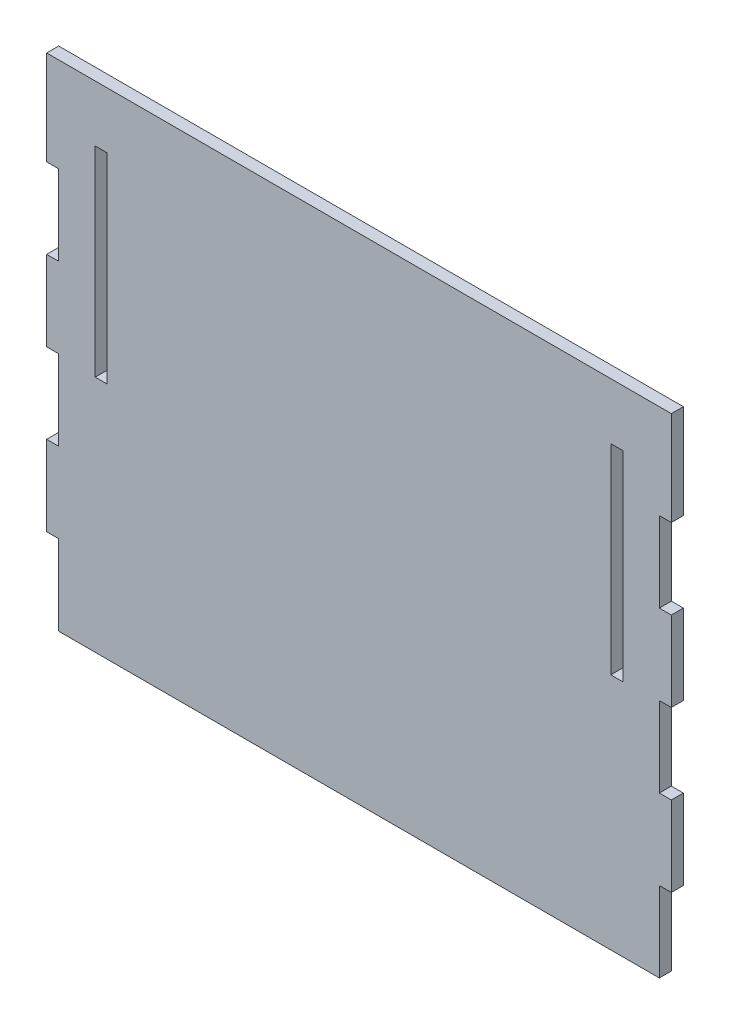
ISO-10303-21;
HEADER;
FILE_DESCRIPTION(('STEP AP214'),'2;1');
FILE_NAME('part.step','',(''),(''),'','','');
FILE_SCHEMA(('AUTOMOTIVE_DESIGN { 1 0 10303 214 1 1 1 1 }'));
ENDSEC;
DATA;
#1=APPLICATION_CONTEXT('core data for automotive mechanical design processes');
#2=APPLICATION_PROTOCOL_DEFINITION('international standard','automotive_design',2000,#1);
#3=PRODUCT_CONTEXT('',#1,'mechanical');
#4=PRODUCT('Part','Part','',(#3));
#5=PRODUCT_RELATED_PRODUCT_CATEGORY('part','',(#4));
#6=PRODUCT_DEFINITION_FORMATION('','',#4);
#7=PRODUCT_DEFINITION_CONTEXT('part definition',#1,'design');
#8=PRODUCT_DEFINITION('design','',#6,#7);
#9=PRODUCT_DEFINITION_SHAPE('','',#8);
#10=(LENGTH_UNIT() NAMED_UNIT(*) SI_UNIT(.MILLI.,.METRE.));
#11=(NAMED_UNIT(*) PLANE_ANGLE_UNIT() SI_UNIT($,.RADIAN.));
#12=(NAMED_UNIT(*) SI_UNIT($,.STERADIAN.) SOLID_ANGLE_UNIT());
#13=UNCERTAINTY_MEASURE_WITH_UNIT(LENGTH_MEASURE(1.E-05),#10,'distance_accuracy_value','');
#14=(GEOMETRIC_REPRESENTATION_CONTEXT(3) GLOBAL_UNCERTAINTY_ASSIGNED_CONTEXT((#13)) GLOBAL_UNIT_ASSIGNED_CONTEXT((#10,
#11,#12)) REPRESENTATION_CONTEXT('',''));
#15=CARTESIAN_POINT('',(0.,0.,0.));
#16=DIRECTION('',(0.,0.,1.));
#17=DIRECTION('',(1.,0.,0.));
#18=AXIS2_PLACEMENT_3D('',#15,#16,#17);
#19=CARTESIAN_POINT('',(0.,0.,0.));
#20=DIRECTION('',(0.,0.,1.));
#21=DIRECTION('',(1.,0.,0.));
#22=AXIS2_PLACEMENT_3D('',#19,#20,#21);
#23=PLANE('',#22);
#24=DIRECTION('',(1.,0.,0.));
#25=VECTOR('',#24,1.);
#26=CARTESIAN_POINT('',(-283.749999999988,53.3068090026658,0.));
#27=LINE('',#26,#25);
#28=CARTESIAN_POINT('',(-283.749999999988,53.3068090026658,0.));
#29=VERTEX_POINT('',#28);
#30=CARTESIAN_POINT('',(-277.749999999989,53.3068090026658,0.));
#31=VERTEX_POINT('',#30);
#32=EDGE_CURVE('E375',#29,#31,#27,.T.);
#33=ORIENTED_EDGE('',*,*,#32,.T.);
#34=DIRECTION('',(0.,1.,0.));
#35=VECTOR('',#34,1.);
#36=CARTESIAN_POINT('',(-277.749999999989,53.3068090026658,0.));
#37=LINE('',#36,#35);
#38=CARTESIAN_POINT('',(-277.749999999988,153.306809005423,0.));
#39=VERTEX_POINT('',#38);
#40=EDGE_CURVE('E378',#31,#39,#37,.T.);
#41=ORIENTED_EDGE('',*,*,#40,.T.);
#42=DIRECTION('',(-1.,0.,0.));
#43=VECTOR('',#42,1.);
#44=CARTESIAN_POINT('',(-277.749999999988,153.306809005423,0.));
#45=LINE('',#44,#43);
#46=CARTESIAN_POINT('',(-283.749999999988,153.306809005423,0.));
#47=VERTEX_POINT('',#46);
#48=EDGE_CURVE('E194',#39,#47,#45,.T.);
#49=ORIENTED_EDGE('',*,*,#48,.T.);
#50=DIRECTION('',(0.,-1.,0.));
#51=VECTOR('',#50,1.);
#52=CARTESIAN_POINT('',(-283.749999999988,153.306809005423,0.));
#53=LINE('',#52,#51);
#54=EDGE_CURVE('E191',#47,#29,#53,.T.);
#55=ORIENTED_EDGE('',*,*,#54,.T.);
#56=EDGE_LOOP('',(#33,#41,#49,#55));
#57=FACE_BOUND('',#56,.T.);
#58=DIRECTION('',(0.,-1.,0.));
#59=VECTOR('',#58,1.);
#60=CARTESIAN_POINT('',(-307.99999999955,181.409908729636,0.));
#61=LINE('',#60,#59);
#62=CARTESIAN_POINT('',(-307.99999999955,181.409908729636,0.));
#63=VERTEX_POINT('',#62);
#64=CARTESIAN_POINT('',(-307.99999999955,134.306808998087,0.));
#65=VERTEX_POINT('',#64);
#66=EDGE_CURVE('E203',#63,#65,#61,.T.);
#67=ORIENTED_EDGE('',*,*,#66,.F.);
#68=DIRECTION('',(-1.,-1.6765570413475E-11,0.));
#69=VECTOR('',#68,1.);
#70=CARTESIAN_POINT('',(-301.99999999955,181.409908729636,0.));
#71=LINE('',#70,#69);
#72=CARTESIAN_POINT('',(3.99999999999985,181.409908734666,0.));
#73=VERTEX_POINT('',#72);
#74=EDGE_CURVE('E294',#73,#63,#71,.T.);
#75=ORIENTED_EDGE('',*,*,#74,.F.);
#76=DIRECTION('',(0.,1.,0.));
#77=VECTOR('',#76,1.);
#78=CARTESIAN_POINT('',(3.9999999999999,134.306809003117,0.));
#79=LINE('',#78,#77);
#80=CARTESIAN_POINT('',(3.9999999999999,134.306809003117,0.));
#81=VERTEX_POINT('',#80);
#82=EDGE_CURVE('E290',#81,#73,#79,.T.);
#83=ORIENTED_EDGE('',*,*,#82,.F.);
#84=DIRECTION('',(1.,0.,0.));
#85=VECTOR('',#84,1.);
#86=CARTESIAN_POINT('',(-2.0000000000001,134.306809003117,0.));
#87=LINE('',#86,#85);
#88=CARTESIAN_POINT('',(-2.0000000000001,134.306809003117,0.));
#89=VERTEX_POINT('',#88);
#90=EDGE_CURVE('E286',#89,#81,#87,.T.);
#91=ORIENTED_EDGE('',*,*,#90,.F.);
#92=DIRECTION('',(0.,1.,0.));
#93=VECTOR('',#92,1.);
#94=CARTESIAN_POINT('',(-2.0000000000001,134.306809003117,0.));
#95=LINE('',#94,#93);
#96=CARTESIAN_POINT('',(-2.00000000000007,94.306809003117,0.));
#97=VERTEX_POINT('',#96);
#98=EDGE_CURVE('E282',#97,#89,#95,.T.);
#99=ORIENTED_EDGE('',*,*,#98,.F.);
#100=DIRECTION('',(-1.,0.,0.));
#101=VECTOR('',#100,1.);
#102=CARTESIAN_POINT('',(3.99999999999993,94.306809003117,0.));
#103=LINE('',#102,#101);
#104=CARTESIAN_POINT('',(3.99999999999993,94.306809003117,0.));
#105=VERTEX_POINT('',#104);
#106=EDGE_CURVE('E278',#105,#97,#103,.T.);
#107=ORIENTED_EDGE('',*,*,#106,.F.);
#108=DIRECTION('',(0.,1.,0.));
#109=VECTOR('',#108,1.);
#110=CARTESIAN_POINT('',(3.99999999999997,54.306809003117,0.));
#111=LINE('',#110,#109);
#112=CARTESIAN_POINT('',(3.99999999999997,54.306809003117,0.));
#113=VERTEX_POINT('',#112);
#114=EDGE_CURVE('E274',#113,#105,#111,.T.);
#115=ORIENTED_EDGE('',*,*,#114,.F.);
#116=DIRECTION('',(1.,0.,0.));
#117=VECTOR('',#116,1.);
#118=CARTESIAN_POINT('',(-2.00000000000003,54.306809003117,0.));
#119=LINE('',#118,#117);
#120=CARTESIAN_POINT('',(-2.00000000000003,54.306809003117,0.));
#121=VERTEX_POINT('',#120);
#122=EDGE_CURVE('E270',#121,#113,#119,.T.);
#123=ORIENTED_EDGE('',*,*,#122,.F.);
#124=DIRECTION('',(0.,1.,0.));
#125=VECTOR('',#124,1.);
#126=CARTESIAN_POINT('',(-2.00000000000003,54.306809003117,0.));
#127=LINE('',#126,#125);
#128=CARTESIAN_POINT('',(-1.99999999999999,14.3068090031171,0.));
#129=VERTEX_POINT('',#128);
#130=EDGE_CURVE('E266',#129,#121,#127,.T.);
#131=ORIENTED_EDGE('',*,*,#130,.F.);
#132=DIRECTION('',(-1.,0.,0.));
#133=VECTOR('',#132,1.);
#134=CARTESIAN_POINT('',(4.00000000000001,14.3068090031171,0.));
#135=LINE('',#134,#133);
#136=CARTESIAN_POINT('',(4.00000000000001,14.3068090031171,0.));
#137=VERTEX_POINT('',#136);
#138=EDGE_CURVE('E262',#137,#129,#135,.T.);
#139=ORIENTED_EDGE('',*,*,#138,.F.);
#140=DIRECTION('',(0.,1.,0.));
#141=VECTOR('',#140,1.);
#142=CARTESIAN_POINT('',(4.00000000000005,-25.6931909968829,0.));
#143=LINE('',#142,#141);
#144=CARTESIAN_POINT('',(4.00000000000005,-25.6931909968829,0.));
#145=VERTEX_POINT('',#144);
#146=EDGE_CURVE('E258',#145,#137,#143,.T.);
#147=ORIENTED_EDGE('',*,*,#146,.F.);
#148=DIRECTION('',(1.,0.,0.));
#149=VECTOR('',#148,1.);
#150=CARTESIAN_POINT('',(-1.99999999999995,-25.6931909968829,0.));
#151=LINE('',#150,#149);
#152=CARTESIAN_POINT('',(-1.99999999999995,-25.6931909968829,0.));
#153=VERTEX_POINT('',#152);
#154=EDGE_CURVE('E254',#153,#145,#151,.T.);
#155=ORIENTED_EDGE('',*,*,#154,.F.);
#156=DIRECTION('',(0.,1.,0.));
#157=VECTOR('',#156,1.);
#158=CARTESIAN_POINT('',(-1.99999999999995,-25.6931909968829,0.));
#159=LINE('',#158,#157);
#160=CARTESIAN_POINT('',(-1.99999999999991,-65.6931909968829,0.));
#161=VERTEX_POINT('',#160);
#162=EDGE_CURVE('E250',#161,#153,#159,.T.);
#163=ORIENTED_EDGE('',*,*,#162,.F.);
#164=DIRECTION('',(1.,0.,0.));
#165=VECTOR('',#164,1.);
#166=CARTESIAN_POINT('',(-301.999999999547,-65.6931909968829,0.));
#167=LINE('',#166,#165);
#168=CARTESIAN_POINT('',(-301.999999999547,-65.6931909968829,0.));
#169=VERTEX_POINT('',#168);
#170=EDGE_CURVE('E246',#169,#161,#167,.T.);
#171=ORIENTED_EDGE('',*,*,#170,.F.);
#172=DIRECTION('',(0.,-1.,0.));
#173=VECTOR('',#172,1.);
#174=CARTESIAN_POINT('',(-301.999999999548,-25.6931910019126,0.));
#175=LINE('',#174,#173);
#176=CARTESIAN_POINT('',(-301.999999999548,-25.6931910019126,0.));
#177=VERTEX_POINT('',#176);
#178=EDGE_CURVE('E242',#177,#169,#175,.T.);
#179=ORIENTED_EDGE('',*,*,#178,.F.);
#180=DIRECTION('',(1.,0.,0.));
#181=VECTOR('',#180,1.);
#182=CARTESIAN_POINT('',(-307.999999999548,-25.6931910019127,0.));
#183=LINE('',#182,#181);
#184=CARTESIAN_POINT('',(-307.999999999548,-25.6931910019127,0.));
#185=VERTEX_POINT('',#184);
#186=EDGE_CURVE('E238',#185,#177,#183,.T.);
#187=ORIENTED_EDGE('',*,*,#186,.F.);
#188=DIRECTION('',(0.,-1.,0.));
#189=VECTOR('',#188,1.);
#190=CARTESIAN_POINT('',(-307.999999999548,14.3068089980873,0.));
#191=LINE('',#190,#189);
#192=CARTESIAN_POINT('',(-307.999999999548,14.3068089980873,0.));
#193=VERTEX_POINT('',#192);
#194=EDGE_CURVE('E234',#193,#185,#191,.T.);
#195=ORIENTED_EDGE('',*,*,#194,.F.);
#196=DIRECTION('',(-1.,0.,0.));
#197=VECTOR('',#196,1.);
#198=CARTESIAN_POINT('',(-301.999999999548,14.3068089980874,0.));
#199=LINE('',#198,#197);
#200=CARTESIAN_POINT('',(-301.999999999548,14.3068089980874,0.));
#201=VERTEX_POINT('',#200);
#202=EDGE_CURVE('E230',#201,#193,#199,.T.);
#203=ORIENTED_EDGE('',*,*,#202,.F.);
#204=DIRECTION('',(0.,-1.,0.));
#205=VECTOR('',#204,1.);
#206=CARTESIAN_POINT('',(-301.999999999549,54.3068089980873,0.));
#207=LINE('',#206,#205);
#208=CARTESIAN_POINT('',(-301.999999999549,54.3068089980873,0.));
#209=VERTEX_POINT('',#208);
#210=EDGE_CURVE('E226',#209,#201,#207,.T.);
#211=ORIENTED_EDGE('',*,*,#210,.F.);
#212=DIRECTION('',(1.,0.,0.));
#213=VECTOR('',#212,1.);
#214=CARTESIAN_POINT('',(-307.999999999549,54.3068089980873,0.));
#215=LINE('',#214,#213);
#216=CARTESIAN_POINT('',(-307.999999999549,54.3068089980873,0.));
#217=VERTEX_POINT('',#216);
#218=EDGE_CURVE('E222',#217,#209,#215,.T.);
#219=ORIENTED_EDGE('',*,*,#218,.F.);
#220=DIRECTION('',(0.,-1.,0.));
#221=VECTOR('',#220,1.);
#222=CARTESIAN_POINT('',(-307.999999999549,94.3068089980872,0.));
#223=LINE('',#222,#221);
#224=CARTESIAN_POINT('',(-307.999999999549,94.3068089980872,0.));
#225=VERTEX_POINT('',#224);
#226=EDGE_CURVE('E218',#225,#217,#223,.T.);
#227=ORIENTED_EDGE('',*,*,#226,.F.);
#228=DIRECTION('',(-1.,0.,0.));
#229=VECTOR('',#228,1.);
#230=CARTESIAN_POINT('',(-301.999999999549,94.3068089980873,0.));
#231=LINE('',#230,#229);
#232=CARTESIAN_POINT('',(-301.999999999549,94.3068089980873,0.));
#233=VERTEX_POINT('',#232);
#234=EDGE_CURVE('E214',#233,#225,#231,.T.);
#235=ORIENTED_EDGE('',*,*,#234,.F.);
#236=DIRECTION('',(0.,-1.,0.));
#237=VECTOR('',#236,1.);
#238=CARTESIAN_POINT('',(-301.99999999955,134.306808998087,0.));
#239=LINE('',#238,#237);
#240=CARTESIAN_POINT('',(-301.99999999955,134.306808998087,0.));
#241=VERTEX_POINT('',#240);
#242=EDGE_CURVE('E210',#241,#233,#239,.T.);
#243=ORIENTED_EDGE('',*,*,#242,.F.);
#244=DIRECTION('',(1.,0.,0.));
#245=VECTOR('',#244,1.);
#246=CARTESIAN_POINT('',(-307.99999999955,134.306808998087,0.));
#247=LINE('',#246,#245);
#248=EDGE_CURVE('E206',#65,#241,#247,.T.);
#249=ORIENTED_EDGE('',*,*,#248,.F.);
#250=EDGE_LOOP('',(#67,#75,#83,#91,#99,#107,#115,#123,#131,#139,#147,#155,#163,#171,#179,#187,
#195,#203,#211,#219,#227,#235,#243,#249));
#251=FACE_BOUND('',#250,.T.);
#252=DIRECTION('',(1.,0.,0.));
#253=VECTOR('',#252,1.);
#254=CARTESIAN_POINT('',(-26.2499999999881,53.3068090026383,0.));
#255=LINE('',#254,#253);
#256=CARTESIAN_POINT('',(-26.2499999999881,53.3068090026383,0.));
#257=VERTEX_POINT('',#256);
#258=CARTESIAN_POINT('',(-20.2499999999881,53.3068090026383,0.));
#259=VERTEX_POINT('',#258);
#260=EDGE_CURVE('E177',#257,#259,#255,.T.);
#261=ORIENTED_EDGE('',*,*,#260,.T.);
#262=DIRECTION('',(0.,1.,0.));
#263=VECTOR('',#262,1.);
#264=CARTESIAN_POINT('',(-20.2499999999881,53.3068090026383,0.));
#265=LINE('',#264,#263);
#266=CARTESIAN_POINT('',(-20.2499999999881,153.306809005396,0.));
#267=VERTEX_POINT('',#266);
#268=EDGE_CURVE('E183',#259,#267,#265,.T.);
#269=ORIENTED_EDGE('',*,*,#268,.T.);
#270=DIRECTION('',(-1.,0.,0.));
#271=VECTOR('',#270,1.);
#272=CARTESIAN_POINT('',(-20.2499999999881,153.306809005396,0.));
#273=LINE('',#272,#271);
#274=CARTESIAN_POINT('',(-26.2499999999881,153.306809005396,0.));
#275=VERTEX_POINT('',#274);
#276=EDGE_CURVE('E187',#267,#275,#273,.T.);
#277=ORIENTED_EDGE('',*,*,#276,.T.);
#278=DIRECTION('',(0.,-1.,0.));
#279=VECTOR('',#278,1.);
#280=CARTESIAN_POINT('',(-26.2499999999881,153.306809005396,0.));
#281=LINE('',#280,#279);
#282=EDGE_CURVE('E190',#275,#257,#281,.T.);
#283=ORIENTED_EDGE('',*,*,#282,.T.);
#284=EDGE_LOOP('',(#261,#269,#277,#283));
#285=FACE_BOUND('',#284,.T.);
#286=ADVANCED_FACE('F33',(#57,#251,#285),#23,.F.);
#287=CARTESIAN_POINT('',(-307.99999999955,181.409908729636,403.999927006222));
#288=DIRECTION('',(1.,0.,0.));
#289=DIRECTION('',(0.,1.,0.));
#290=AXIS2_PLACEMENT_3D('',#287,#288,#289);
#291=PLANE('',#290);
#292=DIRECTION('',(0.,0.,-1.));
#293=VECTOR('',#292,1.);
#294=CARTESIAN_POINT('',(-307.99999999955,134.306808998087,403.999927006222));
#295=LINE('',#294,#293);
#296=CARTESIAN_POINT('',(-307.99999999955,134.306808998087,6.00000000094542));
#297=VERTEX_POINT('',#296);
#298=EDGE_CURVE('E204',#297,#65,#295,.T.);
#299=ORIENTED_EDGE('',*,*,#298,.F.);
#300=DIRECTION('',(0.,1.,7.45329378795912E-12));
#301=VECTOR('',#300,1.);
#302=CARTESIAN_POINT('',(-307.99999999955,181.409908732603,6.00000000129647));
#303=LINE('',#302,#301);
#304=CARTESIAN_POINT('',(-307.99999999955,181.409908729536,6.00000000129647));
#305=VERTEX_POINT('',#304);
#306=EDGE_CURVE('E52',#297,#305,#303,.T.);
#307=ORIENTED_EDGE('',*,*,#306,.T.);
#308=DIRECTION('',(0.,0.,-1.));
#309=VECTOR('',#308,1.);
#310=CARTESIAN_POINT('',(-307.99999999955,181.409908729636,403.999927006222));
#311=LINE('',#310,#309);
#312=EDGE_CURVE('E201',#305,#63,#311,.T.);
#313=ORIENTED_EDGE('',*,*,#312,.T.);
#314=ORIENTED_EDGE('',*,*,#66,.T.);
#315=EDGE_LOOP('',(#299,#307,#313,#314));
#316=FACE_BOUND('',#315,.T.);
#317=ADVANCED_FACE('F441',(#316),#291,.F.);
#318=CARTESIAN_POINT('',(-307.99999999955,134.306808998087,403.999927006222));
#319=DIRECTION('',(0.,1.,0.));
#320=DIRECTION('',(-1.,0.,0.));
#321=AXIS2_PLACEMENT_3D('',#318,#319,#320);
#322=PLANE('',#321);
#323=DIRECTION('',(0.,0.,-1.));
#324=VECTOR('',#323,1.);
#325=CARTESIAN_POINT('',(-301.99999999955,134.306808998087,403.999927006222));
#326=LINE('',#325,#324);
#327=CARTESIAN_POINT('',(-301.99999999955,134.306808998087,6.00000000094542));
#328=VERTEX_POINT('',#327);
#329=EDGE_CURVE('E208',#328,#241,#326,.T.);
#330=ORIENTED_EDGE('',*,*,#329,.F.);
#331=DIRECTION('',(-1.,0.,0.));
#332=VECTOR('',#331,1.);
#333=CARTESIAN_POINT('',(-307.99999999955,134.306808998087,6.00000000094542));
#334=LINE('',#333,#332);
#335=EDGE_CURVE('E207',#328,#297,#334,.T.);
#336=ORIENTED_EDGE('',*,*,#335,.T.);
#337=ORIENTED_EDGE('',*,*,#298,.T.);
#338=ORIENTED_EDGE('',*,*,#248,.T.);
#339=EDGE_LOOP('',(#330,#336,#337,#338));
#340=FACE_BOUND('',#339,.T.);
#341=ADVANCED_FACE('F444',(#340),#322,.F.);
#342=CARTESIAN_POINT('',(-301.99999999955,134.306808998087,403.999927006222));
#343=DIRECTION('',(1.,0.,0.));
#344=DIRECTION('',(0.,1.,0.));
#345=AXIS2_PLACEMENT_3D('',#342,#343,#344);
#346=PLANE('',#345);
#347=DIRECTION('',(0.,0.,-1.));
#348=VECTOR('',#347,1.);
#349=CARTESIAN_POINT('',(-301.999999999549,94.3068089980873,403.999927006222));
#350=LINE('',#349,#348);
#351=CARTESIAN_POINT('',(-301.999999999549,94.3068089980873,6.00000000064727));
#352=VERTEX_POINT('',#351);
#353=EDGE_CURVE('E212',#352,#233,#350,.T.);
#354=ORIENTED_EDGE('',*,*,#353,.F.);
#355=DIRECTION('',(0.,1.,7.45329378795912E-12));
#356=VECTOR('',#355,1.);
#357=CARTESIAN_POINT('',(-301.99999999955,134.306809001054,6.00000000094542));
#358=LINE('',#357,#356);
#359=EDGE_CURVE('E211',#352,#328,#358,.T.);
#360=ORIENTED_EDGE('',*,*,#359,.T.);
#361=ORIENTED_EDGE('',*,*,#329,.T.);
#362=ORIENTED_EDGE('',*,*,#242,.T.);
#363=EDGE_LOOP('',(#354,#360,#361,#362));
#364=FACE_BOUND('',#363,.T.);
#365=ADVANCED_FACE('F820',(#364),#346,.F.);
#366=CARTESIAN_POINT('',(-301.999999999549,94.3068089980873,403.999927006222));
#367=DIRECTION('',(0.,-1.,0.));
#368=DIRECTION('',(1.,0.,0.));
#369=AXIS2_PLACEMENT_3D('',#366,#367,#368);
#370=PLANE('',#369);
#371=DIRECTION('',(0.,0.,-1.));
#372=VECTOR('',#371,1.);
#373=CARTESIAN_POINT('',(-307.999999999549,94.3068089980872,403.999927006222));
#374=LINE('',#373,#372);
#375=CARTESIAN_POINT('',(-307.999999999549,94.3068089980872,6.00000000064727));
#376=VERTEX_POINT('',#375);
#377=EDGE_CURVE('E216',#376,#225,#374,.T.);
#378=ORIENTED_EDGE('',*,*,#377,.F.);
#379=DIRECTION('',(1.,0.,0.));
#380=VECTOR('',#379,1.);
#381=CARTESIAN_POINT('',(-301.999999999549,94.3068089980873,6.00000000064727));
#382=LINE('',#381,#380);
#383=EDGE_CURVE('E215',#376,#352,#382,.T.);
#384=ORIENTED_EDGE('',*,*,#383,.T.);
#385=ORIENTED_EDGE('',*,*,#353,.T.);
#386=ORIENTED_EDGE('',*,*,#234,.T.);
#387=EDGE_LOOP('',(#378,#384,#385,#386));
#388=FACE_BOUND('',#387,.T.);
#389=ADVANCED_FACE('F810',(#388),#370,.F.);
#390=CARTESIAN_POINT('',(-307.999999999549,94.3068089980872,403.999927006222));
#391=DIRECTION('',(1.,0.,0.));
#392=DIRECTION('',(0.,1.,0.));
#393=AXIS2_PLACEMENT_3D('',#390,#391,#392);
#394=PLANE('',#393);
#395=DIRECTION('',(0.,0.,-1.));
#396=VECTOR('',#395,1.);
#397=CARTESIAN_POINT('',(-307.999999999549,54.3068089980873,403.999927006222));
#398=LINE('',#397,#396);
#399=CARTESIAN_POINT('',(-307.999999999549,54.3068089980873,6.00000000034911));
#400=VERTEX_POINT('',#399);
#401=EDGE_CURVE('E220',#400,#217,#398,.T.);
#402=ORIENTED_EDGE('',*,*,#401,.F.);
#403=DIRECTION('',(0.,1.,7.45329378795912E-12));
#404=VECTOR('',#403,1.);
#405=CARTESIAN_POINT('',(-307.999999999549,94.3068090010536,6.00000000064727));
#406=LINE('',#405,#404);
#407=EDGE_CURVE('E219',#400,#376,#406,.T.);
#408=ORIENTED_EDGE('',*,*,#407,.T.);
#409=ORIENTED_EDGE('',*,*,#377,.T.);
#410=ORIENTED_EDGE('',*,*,#226,.T.);
#411=EDGE_LOOP('',(#402,#408,#409,#410));
#412=FACE_BOUND('',#411,.T.);
#413=ADVANCED_FACE('F800',(#412),#394,.F.);
#414=CARTESIAN_POINT('',(-307.999999999549,54.3068089980873,403.999927006222));
#415=DIRECTION('',(0.,1.,0.));
#416=DIRECTION('',(-1.,0.,0.));
#417=AXIS2_PLACEMENT_3D('',#414,#415,#416);
#418=PLANE('',#417);
#419=DIRECTION('',(0.,0.,-1.));
#420=VECTOR('',#419,1.);
#421=CARTESIAN_POINT('',(-301.999999999549,54.3068089980873,403.999927006222));
#422=LINE('',#421,#420);
#423=CARTESIAN_POINT('',(-301.999999999549,54.3068089980873,6.00000000034911));
#424=VERTEX_POINT('',#423);
#425=EDGE_CURVE('E224',#424,#209,#422,.T.);
#426=ORIENTED_EDGE('',*,*,#425,.F.);
#427=DIRECTION('',(-1.,0.,0.));
#428=VECTOR('',#427,1.);
#429=CARTESIAN_POINT('',(-307.999999999549,54.3068089980873,6.00000000034911));
#430=LINE('',#429,#428);
#431=EDGE_CURVE('E223',#424,#400,#430,.T.);
#432=ORIENTED_EDGE('',*,*,#431,.T.);
#433=ORIENTED_EDGE('',*,*,#401,.T.);
#434=ORIENTED_EDGE('',*,*,#218,.T.);
#435=EDGE_LOOP('',(#426,#432,#433,#434));
#436=FACE_BOUND('',#435,.T.);
#437=ADVANCED_FACE('F790',(#436),#418,.F.);
#438=CARTESIAN_POINT('',(-301.999999999549,54.3068089980873,403.999927006222));
#439=DIRECTION('',(1.,0.,0.));
#440=DIRECTION('',(0.,1.,0.));
#441=AXIS2_PLACEMENT_3D('',#438,#439,#440);
#442=PLANE('',#441);
#443=DIRECTION('',(0.,0.,-1.));
#444=VECTOR('',#443,1.);
#445=CARTESIAN_POINT('',(-301.999999999548,14.3068089980874,403.999927006222));
#446=LINE('',#445,#444);
#447=CARTESIAN_POINT('',(-301.999999999548,14.3068089980874,6.00000000005102));
#448=VERTEX_POINT('',#447);
#449=EDGE_CURVE('E228',#448,#201,#446,.T.);
#450=ORIENTED_EDGE('',*,*,#449,.F.);
#451=DIRECTION('',(0.,1.,7.45329378795912E-12));
#452=VECTOR('',#451,1.);
#453=CARTESIAN_POINT('',(-301.999999999549,54.3068090010538,6.00000000034911));
#454=LINE('',#453,#452);
#455=EDGE_CURVE('E227',#448,#424,#454,.T.);
#456=ORIENTED_EDGE('',*,*,#455,.T.);
#457=ORIENTED_EDGE('',*,*,#425,.T.);
#458=ORIENTED_EDGE('',*,*,#210,.T.);
#459=EDGE_LOOP('',(#450,#456,#457,#458));
#460=FACE_BOUND('',#459,.T.);
#461=ADVANCED_FACE('F780',(#460),#442,.F.);
#462=CARTESIAN_POINT('',(-301.999999999548,14.3068089980874,403.999927006222));
#463=DIRECTION('',(0.,-1.,0.));
#464=DIRECTION('',(1.,0.,0.));
#465=AXIS2_PLACEMENT_3D('',#462,#463,#464);
#466=PLANE('',#465);
#467=DIRECTION('',(0.,0.,-1.));
#468=VECTOR('',#467,1.);
#469=CARTESIAN_POINT('',(-307.999999999548,14.3068089980873,403.999927006222));
#470=LINE('',#469,#468);
#471=CARTESIAN_POINT('',(-307.999999999548,14.3068089980873,6.00000000005102));
#472=VERTEX_POINT('',#471);
#473=EDGE_CURVE('E232',#472,#193,#470,.T.);
#474=ORIENTED_EDGE('',*,*,#473,.F.);
#475=DIRECTION('',(1.,0.,0.));
#476=VECTOR('',#475,1.);
#477=CARTESIAN_POINT('',(-301.999999999548,14.3068089980874,6.00000000005102));
#478=LINE('',#477,#476);
#479=EDGE_CURVE('E231',#472,#448,#478,.T.);
#480=ORIENTED_EDGE('',*,*,#479,.T.);
#481=ORIENTED_EDGE('',*,*,#449,.T.);
#482=ORIENTED_EDGE('',*,*,#202,.T.);
#483=EDGE_LOOP('',(#474,#480,#481,#482));
#484=FACE_BOUND('',#483,.T.);
#485=ADVANCED_FACE('F770',(#484),#466,.F.);
#486=CARTESIAN_POINT('',(-307.999999999548,14.3068089980873,403.999927006222));
#487=DIRECTION('',(1.,0.,0.));
#488=DIRECTION('',(0.,1.,0.));
#489=AXIS2_PLACEMENT_3D('',#486,#487,#488);
#490=PLANE('',#489);
#491=DIRECTION('',(0.,0.,-1.));
#492=VECTOR('',#491,1.);
#493=CARTESIAN_POINT('',(-307.999999999548,-25.6931910019127,403.999927006222));
#494=LINE('',#493,#492);
#495=CARTESIAN_POINT('',(-307.999999999548,-25.6931910019127,5.99999999975287));
#496=VERTEX_POINT('',#495);
#497=EDGE_CURVE('E236',#496,#185,#494,.T.);
#498=ORIENTED_EDGE('',*,*,#497,.F.);
#499=DIRECTION('',(0.,1.,7.45329378795912E-12));
#500=VECTOR('',#499,1.);
#501=CARTESIAN_POINT('',(-307.999999999548,14.3068090010537,6.00000000005102));
#502=LINE('',#501,#500);
#503=EDGE_CURVE('E235',#496,#472,#502,.T.);
#504=ORIENTED_EDGE('',*,*,#503,.T.);
#505=ORIENTED_EDGE('',*,*,#473,.T.);
#506=ORIENTED_EDGE('',*,*,#194,.T.);
#507=EDGE_LOOP('',(#498,#504,#505,#506));
#508=FACE_BOUND('',#507,.T.);
#509=ADVANCED_FACE('F760',(#508),#490,.F.);
#510=CARTESIAN_POINT('',(-307.999999999548,-25.6931910019127,403.999927006222));
#511=DIRECTION('',(0.,1.,0.));
#512=DIRECTION('',(-1.,0.,0.));
#513=AXIS2_PLACEMENT_3D('',#510,#511,#512);
#514=PLANE('',#513);
#515=DIRECTION('',(0.,0.,-1.));
#516=VECTOR('',#515,1.);
#517=CARTESIAN_POINT('',(-301.999999999548,-25.6931910019126,403.999927006222));
#518=LINE('',#517,#516);
#519=CARTESIAN_POINT('',(-301.999999999548,-25.6931910019126,5.99999999975287));
#520=VERTEX_POINT('',#519);
#521=EDGE_CURVE('E240',#520,#177,#518,.T.);
#522=ORIENTED_EDGE('',*,*,#521,.F.);
#523=DIRECTION('',(-1.,0.,0.));
#524=VECTOR('',#523,1.);
#525=CARTESIAN_POINT('',(-307.999999999548,-25.6931910019127,5.99999999975287));
#526=LINE('',#525,#524);
#527=EDGE_CURVE('E239',#520,#496,#526,.T.);
#528=ORIENTED_EDGE('',*,*,#527,.T.);
#529=ORIENTED_EDGE('',*,*,#497,.T.);
#530=ORIENTED_EDGE('',*,*,#186,.T.);
#531=EDGE_LOOP('',(#522,#528,#529,#530));
#532=FACE_BOUND('',#531,.T.);
#533=ADVANCED_FACE('F750',(#532),#514,.F.);
#534=CARTESIAN_POINT('',(-301.999999999548,-25.6931910019126,403.999927006222));
#535=DIRECTION('',(1.,0.,0.));
#536=DIRECTION('',(0.,1.,0.));
#537=AXIS2_PLACEMENT_3D('',#534,#535,#536);
#538=PLANE('',#537);
#539=DIRECTION('',(0.,0.,-1.));
#540=VECTOR('',#539,1.);
#541=CARTESIAN_POINT('',(-301.999999999547,-65.6931909968829,403.999927006222));
#542=LINE('',#541,#540);
#543=CARTESIAN_POINT('',(-301.999999999547,-65.6931909968829,5.99999999945472));
#544=VERTEX_POINT('',#543);
#545=EDGE_CURVE('E244',#544,#169,#542,.T.);
#546=ORIENTED_EDGE('',*,*,#545,.F.);
#547=DIRECTION('',(0.,1.,7.45329378795912E-12));
#548=VECTOR('',#547,1.);
#549=CARTESIAN_POINT('',(-301.999999999548,-25.6931909989462,5.99999999975287));
#550=LINE('',#549,#548);
#551=EDGE_CURVE('E243',#544,#520,#550,.T.);
#552=ORIENTED_EDGE('',*,*,#551,.T.);
#553=ORIENTED_EDGE('',*,*,#521,.T.);
#554=ORIENTED_EDGE('',*,*,#178,.T.);
#555=EDGE_LOOP('',(#546,#552,#553,#554));
#556=FACE_BOUND('',#555,.T.);
#557=ADVANCED_FACE('F740',(#556),#538,.F.);
#558=CARTESIAN_POINT('',(-301.999999999547,-65.6931909968829,403.999927006222));
#559=DIRECTION('',(0.,1.,0.));
#560=DIRECTION('',(0.,0.,1.));
#561=AXIS2_PLACEMENT_3D('',#558,#559,#560);
#562=PLANE('',#561);
#563=DIRECTION('',(0.,0.,-1.));
#564=VECTOR('',#563,1.);
#565=CARTESIAN_POINT('',(-1.99999999999991,-65.6931909968829,403.999927006222));
#566=LINE('',#565,#564);
#567=CARTESIAN_POINT('',(-1.99999999999991,-65.6931909968829,5.99999999945474));
#568=VERTEX_POINT('',#567);
#569=EDGE_CURVE('E248',#568,#161,#566,.T.);
#570=ORIENTED_EDGE('',*,*,#569,.F.);
#571=DIRECTION('',(-1.,0.,0.));
#572=VECTOR('',#571,1.);
#573=CARTESIAN_POINT('',(-301.999999999547,-65.6931909968829,5.99999999945472));
#574=LINE('',#573,#572);
#575=EDGE_CURVE('E247',#568,#544,#574,.T.);
#576=ORIENTED_EDGE('',*,*,#575,.T.);
#577=ORIENTED_EDGE('',*,*,#545,.T.);
#578=ORIENTED_EDGE('',*,*,#170,.T.);
#579=EDGE_LOOP('',(#570,#576,#577,#578));
#580=FACE_BOUND('',#579,.T.);
#581=ADVANCED_FACE('F730',(#580),#562,.F.);
#582=CARTESIAN_POINT('',(-1.99999999999995,-25.6931909968829,403.999927006222));
#583=DIRECTION('',(-1.,0.,0.));
#584=DIRECTION('',(0.,-1.,0.));
#585=AXIS2_PLACEMENT_3D('',#582,#583,#584);
#586=PLANE('',#585);
#587=DIRECTION('',(0.,0.,-1.));
#588=VECTOR('',#587,1.);
#589=CARTESIAN_POINT('',(-1.99999999999995,-25.6931909968829,403.999927006222));
#590=LINE('',#589,#588);
#591=CARTESIAN_POINT('',(-1.99999999999995,-25.6931909968829,5.99999999975287));
#592=VERTEX_POINT('',#591);
#593=EDGE_CURVE('E252',#592,#153,#590,.T.);
#594=ORIENTED_EDGE('',*,*,#593,.F.);
#595=DIRECTION('',(0.,-1.,-7.45329378795912E-12));
#596=VECTOR('',#595,1.);
#597=CARTESIAN_POINT('',(-1.99999999999995,-25.6931909939165,5.99999999975287));
#598=LINE('',#597,#596);
#599=EDGE_CURVE('E251',#592,#568,#598,.T.);
#600=ORIENTED_EDGE('',*,*,#599,.T.);
#601=ORIENTED_EDGE('',*,*,#569,.T.);
#602=ORIENTED_EDGE('',*,*,#162,.T.);
#603=EDGE_LOOP('',(#594,#600,#601,#602));
#604=FACE_BOUND('',#603,.T.);
#605=ADVANCED_FACE('F720',(#604),#586,.F.);
#606=CARTESIAN_POINT('',(-1.99999999999995,-25.6931909968829,403.999927006222));
#607=DIRECTION('',(0.,1.,0.));
#608=DIRECTION('',(-1.,0.,0.));
#609=AXIS2_PLACEMENT_3D('',#606,#607,#608);
#610=PLANE('',#609);
#611=DIRECTION('',(0.,0.,-1.));
#612=VECTOR('',#611,1.);
#613=CARTESIAN_POINT('',(4.00000000000005,-25.6931909968829,403.999927006222));
#614=LINE('',#613,#612);
#615=CARTESIAN_POINT('',(4.00000000000005,-25.6931909968829,5.99999999975287));
#616=VERTEX_POINT('',#615);
#617=EDGE_CURVE('E256',#616,#145,#614,.T.);
#618=ORIENTED_EDGE('',*,*,#617,.F.);
#619=DIRECTION('',(-1.,0.,0.));
#620=VECTOR('',#619,1.);
#621=CARTESIAN_POINT('',(-1.99999999999993,-25.6931909968829,5.99999999975287));
#622=LINE('',#621,#620);
#623=EDGE_CURVE('E255',#616,#592,#622,.T.);
#624=ORIENTED_EDGE('',*,*,#623,.T.);
#625=ORIENTED_EDGE('',*,*,#593,.T.);
#626=ORIENTED_EDGE('',*,*,#154,.T.);
#627=EDGE_LOOP('',(#618,#624,#625,#626));
#628=FACE_BOUND('',#627,.T.);
#629=ADVANCED_FACE('F710',(#628),#610,.F.);
#630=CARTESIAN_POINT('',(4.00000000000005,-25.6931909968829,403.999927006222));
#631=DIRECTION('',(-1.,0.,0.));
#632=DIRECTION('',(0.,-1.,0.));
#633=AXIS2_PLACEMENT_3D('',#630,#631,#632);
#634=PLANE('',#633);
#635=DIRECTION('',(0.,0.,-1.));
#636=VECTOR('',#635,1.);
#637=CARTESIAN_POINT('',(4.00000000000001,14.3068090031171,403.999927006222));
#638=LINE('',#637,#636);
#639=CARTESIAN_POINT('',(4.00000000000001,14.3068090031171,6.00000000005102));
#640=VERTEX_POINT('',#639);
#641=EDGE_CURVE('E260',#640,#137,#638,.T.);
#642=ORIENTED_EDGE('',*,*,#641,.F.);
#643=DIRECTION('',(0.,-1.,-7.45329378795912E-12));
#644=VECTOR('',#643,1.);
#645=CARTESIAN_POINT('',(4.00000000000005,-25.6931909939165,5.99999999975287));
#646=LINE('',#645,#644);
#647=EDGE_CURVE('E259',#640,#616,#646,.T.);
#648=ORIENTED_EDGE('',*,*,#647,.T.);
#649=ORIENTED_EDGE('',*,*,#617,.T.);
#650=ORIENTED_EDGE('',*,*,#146,.T.);
#651=EDGE_LOOP('',(#642,#648,#649,#650));
#652=FACE_BOUND('',#651,.T.);
#653=ADVANCED_FACE('F700',(#652),#634,.F.);
#654=CARTESIAN_POINT('',(4.00000000000001,14.3068090031171,403.999927006222));
#655=DIRECTION('',(0.,-1.,0.));
#656=DIRECTION('',(1.,0.,0.));
#657=AXIS2_PLACEMENT_3D('',#654,#655,#656);
#658=PLANE('',#657);
#659=DIRECTION('',(0.,0.,-1.));
#660=VECTOR('',#659,1.);
#661=CARTESIAN_POINT('',(-1.99999999999999,14.3068090031171,403.999927006222));
#662=LINE('',#661,#660);
#663=CARTESIAN_POINT('',(-1.99999999999999,14.3068090031171,6.00000000005104));
#664=VERTEX_POINT('',#663);
#665=EDGE_CURVE('E264',#664,#129,#662,.T.);
#666=ORIENTED_EDGE('',*,*,#665,.F.);
#667=DIRECTION('',(1.,0.,0.));
#668=VECTOR('',#667,1.);
#669=CARTESIAN_POINT('',(4.00000000000004,14.3068090031171,6.00000000005102));
#670=LINE('',#669,#668);
#671=EDGE_CURVE('E263',#664,#640,#670,.T.);
#672=ORIENTED_EDGE('',*,*,#671,.T.);
#673=ORIENTED_EDGE('',*,*,#641,.T.);
#674=ORIENTED_EDGE('',*,*,#138,.T.);
#675=EDGE_LOOP('',(#666,#672,#673,#674));
#676=FACE_BOUND('',#675,.T.);
#677=ADVANCED_FACE('F690',(#676),#658,.F.);
#678=CARTESIAN_POINT('',(-2.00000000000003,54.306809003117,403.999927006222));
#679=DIRECTION('',(-1.,0.,0.));
#680=DIRECTION('',(0.,-1.,0.));
#681=AXIS2_PLACEMENT_3D('',#678,#679,#680);
#682=PLANE('',#681);
#683=DIRECTION('',(0.,0.,-1.));
#684=VECTOR('',#683,1.);
#685=CARTESIAN_POINT('',(-2.00000000000003,54.306809003117,403.999927006222));
#686=LINE('',#685,#684);
#687=CARTESIAN_POINT('',(-2.00000000000003,54.306809003117,6.00000000034917));
#688=VERTEX_POINT('',#687);
#689=EDGE_CURVE('E268',#688,#121,#686,.T.);
#690=ORIENTED_EDGE('',*,*,#689,.F.);
#691=DIRECTION('',(0.,-1.,-7.45329378795912E-12));
#692=VECTOR('',#691,1.);
#693=CARTESIAN_POINT('',(-2.00000000000003,54.3068090060834,6.00000000034917));
#694=LINE('',#693,#692);
#695=EDGE_CURVE('E267',#688,#664,#694,.T.);
#696=ORIENTED_EDGE('',*,*,#695,.T.);
#697=ORIENTED_EDGE('',*,*,#665,.T.);
#698=ORIENTED_EDGE('',*,*,#130,.T.);
#699=EDGE_LOOP('',(#690,#696,#697,#698));
#700=FACE_BOUND('',#699,.T.);
#701=ADVANCED_FACE('F680',(#700),#682,.F.);
#702=CARTESIAN_POINT('',(-2.00000000000003,54.306809003117,403.999927006222));
#703=DIRECTION('',(0.,1.,0.));
#704=DIRECTION('',(-1.,0.,0.));
#705=AXIS2_PLACEMENT_3D('',#702,#703,#704);
#706=PLANE('',#705);
#707=DIRECTION('',(0.,0.,-1.));
#708=VECTOR('',#707,1.);
#709=CARTESIAN_POINT('',(3.99999999999997,54.306809003117,403.999927006222));
#710=LINE('',#709,#708);
#711=CARTESIAN_POINT('',(3.99999999999997,54.306809003117,6.00000000034917));
#712=VERTEX_POINT('',#711);
#713=EDGE_CURVE('E272',#712,#113,#710,.T.);
#714=ORIENTED_EDGE('',*,*,#713,.F.);
#715=DIRECTION('',(-1.,0.,0.));
#716=VECTOR('',#715,1.);
#717=CARTESIAN_POINT('',(-2.,54.306809003117,6.00000000034917));
#718=LINE('',#717,#716);
#719=EDGE_CURVE('E271',#712,#688,#718,.T.);
#720=ORIENTED_EDGE('',*,*,#719,.T.);
#721=ORIENTED_EDGE('',*,*,#689,.T.);
#722=ORIENTED_EDGE('',*,*,#122,.T.);
#723=EDGE_LOOP('',(#714,#720,#721,#722));
#724=FACE_BOUND('',#723,.T.);
#725=ADVANCED_FACE('F670',(#724),#706,.F.);
#726=CARTESIAN_POINT('',(3.99999999999997,54.306809003117,403.999927006222));
#727=DIRECTION('',(-1.,0.,0.));
#728=DIRECTION('',(0.,-1.,0.));
#729=AXIS2_PLACEMENT_3D('',#726,#727,#728);
#730=PLANE('',#729);
#731=DIRECTION('',(0.,0.,-1.));
#732=VECTOR('',#731,1.);
#733=CARTESIAN_POINT('',(3.99999999999993,94.306809003117,403.999927006222));
#734=LINE('',#733,#732);
#735=CARTESIAN_POINT('',(3.99999999999993,94.306809003117,6.00000000064727));
#736=VERTEX_POINT('',#735);
#737=EDGE_CURVE('E276',#736,#105,#734,.T.);
#738=ORIENTED_EDGE('',*,*,#737,.F.);
#739=DIRECTION('',(0.,-1.,-7.45329378795912E-12));
#740=VECTOR('',#739,1.);
#741=CARTESIAN_POINT('',(3.99999999999997,54.3068090060834,6.00000000034917));
#742=LINE('',#741,#740);
#743=EDGE_CURVE('E275',#736,#712,#742,.T.);
#744=ORIENTED_EDGE('',*,*,#743,.T.);
#745=ORIENTED_EDGE('',*,*,#713,.T.);
#746=ORIENTED_EDGE('',*,*,#114,.T.);
#747=EDGE_LOOP('',(#738,#744,#745,#746));
#748=FACE_BOUND('',#747,.T.);
#749=ADVANCED_FACE('F660',(#748),#730,.F.);
#750=CARTESIAN_POINT('',(3.99999999999993,94.306809003117,403.999927006222));
#751=DIRECTION('',(0.,-1.,0.));
#752=DIRECTION('',(0.,0.,-1.));
#753=AXIS2_PLACEMENT_3D('',#750,#751,#752);
#754=PLANE('',#753);
#755=DIRECTION('',(0.,0.,-1.));
#756=VECTOR('',#755,1.);
#757=CARTESIAN_POINT('',(-2.00000000000007,94.306809003117,403.999927006222));
#758=LINE('',#757,#756);
#759=CARTESIAN_POINT('',(-2.00000000000007,94.306809003117,6.00000000064728));
#760=VERTEX_POINT('',#759);
#761=EDGE_CURVE('E280',#760,#97,#758,.T.);
#762=ORIENTED_EDGE('',*,*,#761,.F.);
#763=DIRECTION('',(1.,0.,0.));
#764=VECTOR('',#763,1.);
#765=CARTESIAN_POINT('',(3.99999999999996,94.306809003117,6.00000000064727));
#766=LINE('',#765,#764);
#767=EDGE_CURVE('E279',#760,#736,#766,.T.);
#768=ORIENTED_EDGE('',*,*,#767,.T.);
#769=ORIENTED_EDGE('',*,*,#737,.T.);
#770=ORIENTED_EDGE('',*,*,#106,.T.);
#771=EDGE_LOOP('',(#762,#768,#769,#770));
#772=FACE_BOUND('',#771,.T.);
#773=ADVANCED_FACE('F650',(#772),#754,.F.);
#774=CARTESIAN_POINT('',(-2.0000000000001,134.306809003117,403.999927006222));
#775=DIRECTION('',(-1.,0.,0.));
#776=DIRECTION('',(0.,-1.,0.));
#777=AXIS2_PLACEMENT_3D('',#774,#775,#776);
#778=PLANE('',#777);
#779=DIRECTION('',(0.,0.,-1.));
#780=VECTOR('',#779,1.);
#781=CARTESIAN_POINT('',(-2.0000000000001,134.306809003117,403.999927006222));
#782=LINE('',#781,#780);
#783=CARTESIAN_POINT('',(-2.0000000000001,134.306809003117,6.00000000094542));
#784=VERTEX_POINT('',#783);
#785=EDGE_CURVE('E284',#784,#89,#782,.T.);
#786=ORIENTED_EDGE('',*,*,#785,.F.);
#787=DIRECTION('',(0.,-1.,-7.45329378795912E-12));
#788=VECTOR('',#787,1.);
#789=CARTESIAN_POINT('',(-2.0000000000001,134.306809006083,6.00000000094542));
#790=LINE('',#789,#788);
#791=EDGE_CURVE('E283',#784,#760,#790,.T.);
#792=ORIENTED_EDGE('',*,*,#791,.T.);
#793=ORIENTED_EDGE('',*,*,#761,.T.);
#794=ORIENTED_EDGE('',*,*,#98,.T.);
#795=EDGE_LOOP('',(#786,#792,#793,#794));
#796=FACE_BOUND('',#795,.T.);
#797=ADVANCED_FACE('F640',(#796),#778,.F.);
#798=CARTESIAN_POINT('',(-2.0000000000001,134.306809003117,403.999927006222));
#799=DIRECTION('',(0.,1.,0.));
#800=DIRECTION('',(0.,0.,1.));
#801=AXIS2_PLACEMENT_3D('',#798,#799,#800);
#802=PLANE('',#801);
#803=DIRECTION('',(0.,0.,-1.));
#804=VECTOR('',#803,1.);
#805=CARTESIAN_POINT('',(3.9999999999999,134.306809003117,403.999927006222));
#806=LINE('',#805,#804);
#807=CARTESIAN_POINT('',(3.9999999999999,134.306809003117,6.00000000094542));
#808=VERTEX_POINT('',#807);
#809=EDGE_CURVE('E288',#808,#81,#806,.T.);
#810=ORIENTED_EDGE('',*,*,#809,.F.);
#811=DIRECTION('',(-1.,0.,0.));
#812=VECTOR('',#811,1.);
#813=CARTESIAN_POINT('',(-2.00000000000008,134.306809003117,6.00000000094542));
#814=LINE('',#813,#812);
#815=EDGE_CURVE('E287',#808,#784,#814,.T.);
#816=ORIENTED_EDGE('',*,*,#815,.T.);
#817=ORIENTED_EDGE('',*,*,#785,.T.);
#818=ORIENTED_EDGE('',*,*,#90,.T.);
#819=EDGE_LOOP('',(#810,#816,#817,#818));
#820=FACE_BOUND('',#819,.T.);
#821=ADVANCED_FACE('F630',(#820),#802,.F.);
#822=CARTESIAN_POINT('',(3.9999999999999,134.306809003117,403.999927006222));
#823=DIRECTION('',(-1.,0.,0.));
#824=DIRECTION('',(0.,-1.,0.));
#825=AXIS2_PLACEMENT_3D('',#822,#823,#824);
#826=PLANE('',#825);
#827=DIRECTION('',(0.,0.,-1.));
#828=VECTOR('',#827,1.);
#829=CARTESIAN_POINT('',(3.99999999999985,181.409908734666,403.999927006222));
#830=LINE('',#829,#828);
#831=CARTESIAN_POINT('',(3.99999999999985,181.409908734666,6.00000000129647));
#832=VERTEX_POINT('',#831);
#833=EDGE_CURVE('E292',#832,#73,#830,.T.);
#834=ORIENTED_EDGE('',*,*,#833,.F.);
#835=DIRECTION('',(0.,-1.,-7.45329378795912E-12));
#836=VECTOR('',#835,1.);
#837=CARTESIAN_POINT('',(3.9999999999999,134.306809006083,6.00000000094542));
#838=LINE('',#837,#836);
#839=EDGE_CURVE('E291',#832,#808,#838,.T.);
#840=ORIENTED_EDGE('',*,*,#839,.T.);
#841=ORIENTED_EDGE('',*,*,#809,.T.);
#842=ORIENTED_EDGE('',*,*,#82,.T.);
#843=EDGE_LOOP('',(#834,#840,#841,#842));
#844=FACE_BOUND('',#843,.T.);
#845=ADVANCED_FACE('F541',(#844),#826,.F.);
#846=CARTESIAN_POINT('',(-301.99999999955,181.409908729636,403.999927006222));
#847=DIRECTION('',(1.6765570413475E-11,-1.,0.));
#848=DIRECTION('',(1.,1.6765570413475E-11,0.));
#849=AXIS2_PLACEMENT_3D('',#846,#847,#848);
#850=PLANE('',#849);
#851=ORIENTED_EDGE('',*,*,#312,.F.);
#852=DIRECTION('',(1.,1.6765570413475E-11,0.));
#853=VECTOR('',#852,1.);
#854=CARTESIAN_POINT('',(-301.99999999955,181.409908729636,6.00000000129647));
#855=LINE('',#854,#853);
#856=EDGE_CURVE('E295',#305,#832,#855,.T.);
#857=ORIENTED_EDGE('',*,*,#856,.T.);
#858=ORIENTED_EDGE('',*,*,#833,.T.);
#859=ORIENTED_EDGE('',*,*,#74,.T.);
#860=EDGE_LOOP('',(#851,#857,#858,#859));
#861=FACE_BOUND('',#860,.T.);
#862=ADVANCED_FACE('F434',(#861),#850,.F.);
#863=CARTESIAN_POINT('',(-283.749999999988,53.3068090026658,403.999927006222));
#864=DIRECTION('',(0.,1.,0.));
#865=DIRECTION('',(0.,0.,1.));
#866=AXIS2_PLACEMENT_3D('',#863,#864,#865);
#867=PLANE('',#866);
#868=DIRECTION('',(-1.,0.,0.));
#869=VECTOR('',#868,1.);
#870=CARTESIAN_POINT('',(-283.749999999988,53.3068090026658,6.00000000034168));
#871=LINE('',#870,#869);
#872=CARTESIAN_POINT('',(-277.749999999989,53.3068090026658,6.00000000034168));
#873=VERTEX_POINT('',#872);
#874=CARTESIAN_POINT('',(-283.749999999988,53.3068090026658,6.00000000071438));
#875=VERTEX_POINT('',#874);
#876=EDGE_CURVE('E355',#873,#875,#871,.T.);
#877=ORIENTED_EDGE('',*,*,#876,.F.);
#878=DIRECTION('',(0.,0.,-1.));
#879=VECTOR('',#878,1.);
#880=CARTESIAN_POINT('',(-277.749999999989,53.3068090026658,403.999927006222));
#881=LINE('',#880,#879);
#882=EDGE_CURVE('E296',#873,#31,#881,.T.);
#883=ORIENTED_EDGE('',*,*,#882,.T.);
#884=ORIENTED_EDGE('',*,*,#32,.F.);
#885=DIRECTION('',(0.,0.,-1.));
#886=VECTOR('',#885,1.);
#887=CARTESIAN_POINT('',(-283.749999999988,53.3068090026658,403.999927006222));
#888=LINE('',#887,#886);
#889=EDGE_CURVE('E180',#875,#29,#888,.T.);
#890=ORIENTED_EDGE('',*,*,#889,.F.);
#891=EDGE_LOOP('',(#877,#883,#884,#890));
#892=FACE_BOUND('',#891,.T.);
#893=ADVANCED_FACE('F533',(#892),#867,.T.);
#894=CARTESIAN_POINT('',(-277.749999999989,53.3068090026658,403.999927006222));
#895=DIRECTION('',(-1.,0.,0.));
#896=DIRECTION('',(0.,-1.,0.));
#897=AXIS2_PLACEMENT_3D('',#894,#895,#896);
#898=PLANE('',#897);
#899=DIRECTION('',(0.,-1.,-7.45329378795912E-12));
#900=VECTOR('',#899,1.);
#901=CARTESIAN_POINT('',(-277.749999999989,53.3068090056322,6.00000000034168));
#902=LINE('',#901,#900);
#903=CARTESIAN_POINT('',(-277.749999999988,153.306809005423,6.00000000108702));
#904=VERTEX_POINT('',#903);
#905=EDGE_CURVE('E11',#904,#873,#902,.T.);
#906=ORIENTED_EDGE('',*,*,#905,.F.);
#907=DIRECTION('',(0.,0.,-1.));
#908=VECTOR('',#907,1.);
#909=CARTESIAN_POINT('',(-277.749999999988,153.306809005423,403.999927006222));
#910=LINE('',#909,#908);
#911=EDGE_CURVE('E298',#904,#39,#910,.T.);
#912=ORIENTED_EDGE('',*,*,#911,.T.);
#913=ORIENTED_EDGE('',*,*,#40,.F.);
#914=ORIENTED_EDGE('',*,*,#882,.F.);
#915=EDGE_LOOP('',(#906,#912,#913,#914));
#916=FACE_BOUND('',#915,.T.);
#917=ADVANCED_FACE('F531',(#916),#898,.T.);
#918=CARTESIAN_POINT('',(-277.749999999988,153.306809005423,403.999927006222));
#919=DIRECTION('',(0.,-1.,0.));
#920=DIRECTION('',(0.,0.,-1.));
#921=AXIS2_PLACEMENT_3D('',#918,#919,#920);
#922=PLANE('',#921);
#923=DIRECTION('',(1.,0.,0.));
#924=VECTOR('',#923,1.);
#925=CARTESIAN_POINT('',(-277.749999999988,153.306809005423,6.00000000108702));
#926=LINE('',#925,#924);
#927=CARTESIAN_POINT('',(-283.749999999988,153.306809005423,6.00000000108702));
#928=VERTEX_POINT('',#927);
#929=EDGE_CURVE('E43',#928,#904,#926,.T.);
#930=ORIENTED_EDGE('',*,*,#929,.F.);
#931=DIRECTION('',(0.,0.,-1.));
#932=VECTOR('',#931,1.);
#933=CARTESIAN_POINT('',(-283.749999999988,153.306809005423,403.999927006222));
#934=LINE('',#933,#932);
#935=EDGE_CURVE('E300',#928,#47,#934,.T.);
#936=ORIENTED_EDGE('',*,*,#935,.T.);
#937=ORIENTED_EDGE('',*,*,#48,.F.);
#938=ORIENTED_EDGE('',*,*,#911,.F.);
#939=EDGE_LOOP('',(#930,#936,#937,#938));
#940=FACE_BOUND('',#939,.T.);
#941=ADVANCED_FACE('F522',(#940),#922,.T.);
#942=CARTESIAN_POINT('',(-283.749999999988,153.306809005423,403.999927006222));
#943=DIRECTION('',(1.,0.,0.));
#944=DIRECTION('',(0.,0.,-1.));
#945=AXIS2_PLACEMENT_3D('',#942,#943,#944);
#946=PLANE('',#945);
#947=DIRECTION('',(0.,1.,7.45329378795912E-12));
#948=VECTOR('',#947,1.);
#949=CARTESIAN_POINT('',(-283.749999999988,153.30680900839,6.00000000108702));
#950=LINE('',#949,#948);
#951=EDGE_CURVE('E356',#875,#928,#950,.T.);
#952=ORIENTED_EDGE('',*,*,#951,.F.);
#953=ORIENTED_EDGE('',*,*,#889,.T.);
#954=ORIENTED_EDGE('',*,*,#54,.F.);
#955=ORIENTED_EDGE('',*,*,#935,.F.);
#956=EDGE_LOOP('',(#952,#953,#954,#955));
#957=FACE_BOUND('',#956,.T.);
#958=ADVANCED_FACE('F525',(#957),#946,.T.);
#959=CARTESIAN_POINT('',(-26.2499999999881,53.3068090026383,403.999927006222));
#960=DIRECTION('',(0.,1.,0.));
#961=DIRECTION('',(0.,0.,1.));
#962=AXIS2_PLACEMENT_3D('',#959,#960,#961);
#963=PLANE('',#962);
#964=DIRECTION('',(-1.,0.,0.));
#965=VECTOR('',#964,1.);
#966=CARTESIAN_POINT('',(-26.2499999999881,53.3068090026383,6.00000000034168));
#967=LINE('',#966,#965);
#968=CARTESIAN_POINT('',(-20.2499999999881,53.3068090026383,6.00000000034168));
#969=VERTEX_POINT('',#968);
#970=CARTESIAN_POINT('',(-26.2499999999881,53.3068090026383,6.00000000071438));
#971=VERTEX_POINT('',#970);
#972=EDGE_CURVE('E179',#969,#971,#967,.T.);
#973=ORIENTED_EDGE('',*,*,#972,.F.);
#974=DIRECTION('',(0.,0.,-1.));
#975=VECTOR('',#974,1.);
#976=CARTESIAN_POINT('',(-20.2499999999881,53.3068090026383,403.999927006222));
#977=LINE('',#976,#975);
#978=EDGE_CURVE('E173',#969,#259,#977,.T.);
#979=ORIENTED_EDGE('',*,*,#978,.T.);
#980=ORIENTED_EDGE('',*,*,#260,.F.);
#981=DIRECTION('',(0.,0.,-1.));
#982=VECTOR('',#981,1.);
#983=CARTESIAN_POINT('',(-26.2499999999881,53.3068090026383,403.999927006222));
#984=LINE('',#983,#982);
#985=EDGE_CURVE('E306',#971,#257,#984,.T.);
#986=ORIENTED_EDGE('',*,*,#985,.F.);
#987=EDGE_LOOP('',(#973,#979,#980,#986));
#988=FACE_BOUND('',#987,.T.);
#989=ADVANCED_FACE('F174',(#988),#963,.T.);
#990=CARTESIAN_POINT('',(-20.2499999999881,53.3068090026383,403.999927006222));
#991=DIRECTION('',(-1.,0.,0.));
#992=DIRECTION('',(0.,-1.,0.));
#993=AXIS2_PLACEMENT_3D('',#990,#991,#992);
#994=PLANE('',#993);
#995=DIRECTION('',(0.,-1.,-7.45329378795912E-12));
#996=VECTOR('',#995,1.);
#997=CARTESIAN_POINT('',(-20.2499999999881,53.3068090056047,6.00000000034168));
#998=LINE('',#997,#996);
#999=CARTESIAN_POINT('',(-20.2499999999881,153.306809005396,6.00000000108702));
#1000=VERTEX_POINT('',#999);
#1001=EDGE_CURVE('E357',#1000,#969,#998,.T.);
#1002=ORIENTED_EDGE('',*,*,#1001,.F.);
#1003=DIRECTION('',(0.,0.,-1.));
#1004=VECTOR('',#1003,1.);
#1005=CARTESIAN_POINT('',(-20.2499999999881,153.306809005396,403.999927006222));
#1006=LINE('',#1005,#1004);
#1007=EDGE_CURVE('E166',#1000,#267,#1006,.T.);
#1008=ORIENTED_EDGE('',*,*,#1007,.T.);
#1009=ORIENTED_EDGE('',*,*,#268,.F.);
#1010=ORIENTED_EDGE('',*,*,#978,.F.);
#1011=EDGE_LOOP('',(#1002,#1008,#1009,#1010));
#1012=FACE_BOUND('',#1011,.T.);
#1013=ADVANCED_FACE('F184',(#1012),#994,.T.);
#1014=CARTESIAN_POINT('',(-20.2499999999881,153.306809005396,403.999927006222));
#1015=DIRECTION('',(0.,-1.,0.));
#1016=DIRECTION('',(0.,0.,-1.));
#1017=AXIS2_PLACEMENT_3D('',#1014,#1015,#1016);
#1018=PLANE('',#1017);
#1019=DIRECTION('',(1.,0.,0.));
#1020=VECTOR('',#1019,1.);
#1021=CARTESIAN_POINT('',(-20.2499999999881,153.306809005396,6.00000000108702));
#1022=LINE('',#1021,#1020);
#1023=CARTESIAN_POINT('',(-26.2499999999881,153.306809005396,6.00000000108702));
#1024=VERTEX_POINT('',#1023);
#1025=EDGE_CURVE('E37',#1024,#1000,#1022,.T.);
#1026=ORIENTED_EDGE('',*,*,#1025,.F.);
#1027=DIRECTION('',(0.,0.,-1.));
#1028=VECTOR('',#1027,1.);
#1029=CARTESIAN_POINT('',(-26.2499999999881,153.306809005396,403.999927006222));
#1030=LINE('',#1029,#1028);
#1031=EDGE_CURVE('E304',#1024,#275,#1030,.T.);
#1032=ORIENTED_EDGE('',*,*,#1031,.T.);
#1033=ORIENTED_EDGE('',*,*,#276,.F.);
#1034=ORIENTED_EDGE('',*,*,#1007,.F.);
#1035=EDGE_LOOP('',(#1026,#1032,#1033,#1034));
#1036=FACE_BOUND('',#1035,.T.);
#1037=ADVANCED_FACE('F372',(#1036),#1018,.T.);
#1038=CARTESIAN_POINT('',(-26.2499999999881,153.306809005396,403.999927006222));
#1039=DIRECTION('',(1.,0.,0.));
#1040=DIRECTION('',(0.,1.,0.));
#1041=AXIS2_PLACEMENT_3D('',#1038,#1039,#1040);
#1042=PLANE('',#1041);
#1043=DIRECTION('',(0.,1.,7.45329378795912E-12));
#1044=VECTOR('',#1043,1.);
#1045=CARTESIAN_POINT('',(-26.2499999999881,153.306809008362,6.00000000108702));
#1046=LINE('',#1045,#1044);
#1047=EDGE_CURVE('E198',#971,#1024,#1046,.T.);
#1048=ORIENTED_EDGE('',*,*,#1047,.F.);
#1049=ORIENTED_EDGE('',*,*,#985,.T.);
#1050=ORIENTED_EDGE('',*,*,#282,.F.);
#1051=ORIENTED_EDGE('',*,*,#1031,.F.);
#1052=EDGE_LOOP('',(#1048,#1049,#1050,#1051));
#1053=FACE_BOUND('',#1052,.T.);
#1054=ADVANCED_FACE('F578',(#1053),#1042,.T.);
#1055=CARTESIAN_POINT('',(-301.999999999976,94.3068090026681,6.00000000064727));
#1056=DIRECTION('',(0.,7.45329378795912E-12,-1.));
#1057=DIRECTION('',(-1.,0.,0.));
#1058=AXIS2_PLACEMENT_3D('',#1055,#1056,#1057);
#1059=PLANE('',#1058);
#1060=ORIENTED_EDGE('',*,*,#972,.T.);
#1061=ORIENTED_EDGE('',*,*,#1047,.T.);
#1062=ORIENTED_EDGE('',*,*,#1025,.T.);
#1063=ORIENTED_EDGE('',*,*,#1001,.T.);
#1064=EDGE_LOOP('',(#1060,#1061,#1062,#1063));
#1065=FACE_BOUND('',#1064,.T.);
#1066=ORIENTED_EDGE('',*,*,#876,.T.);
#1067=ORIENTED_EDGE('',*,*,#951,.T.);
#1068=ORIENTED_EDGE('',*,*,#929,.T.);
#1069=ORIENTED_EDGE('',*,*,#905,.T.);
#1070=EDGE_LOOP('',(#1066,#1067,#1068,#1069));
#1071=FACE_BOUND('',#1070,.T.);
#1072=ORIENTED_EDGE('',*,*,#335,.F.);
#1073=ORIENTED_EDGE('',*,*,#359,.F.);
#1074=ORIENTED_EDGE('',*,*,#383,.F.);
#1075=ORIENTED_EDGE('',*,*,#407,.F.);
#1076=ORIENTED_EDGE('',*,*,#431,.F.);
#1077=ORIENTED_EDGE('',*,*,#455,.F.);
#1078=ORIENTED_EDGE('',*,*,#479,.F.);
#1079=ORIENTED_EDGE('',*,*,#503,.F.);
#1080=ORIENTED_EDGE('',*,*,#527,.F.);
#1081=ORIENTED_EDGE('',*,*,#551,.F.);
#1082=ORIENTED_EDGE('',*,*,#575,.F.);
#1083=ORIENTED_EDGE('',*,*,#599,.F.);
#1084=ORIENTED_EDGE('',*,*,#623,.F.);
#1085=ORIENTED_EDGE('',*,*,#647,.F.);
#1086=ORIENTED_EDGE('',*,*,#671,.F.);
#1087=ORIENTED_EDGE('',*,*,#695,.F.);
#1088=ORIENTED_EDGE('',*,*,#719,.F.);
#1089=ORIENTED_EDGE('',*,*,#743,.F.);
#1090=ORIENTED_EDGE('',*,*,#767,.F.);
#1091=ORIENTED_EDGE('',*,*,#791,.F.);
#1092=ORIENTED_EDGE('',*,*,#815,.F.);
#1093=ORIENTED_EDGE('',*,*,#839,.F.);
#1094=ORIENTED_EDGE('',*,*,#856,.F.);
#1095=ORIENTED_EDGE('',*,*,#306,.F.);
#1096=EDGE_LOOP('',(#1072,#1073,#1074,#1075,#1076,#1077,#1078,#1079,#1080,#1081,#1082,#1083,
#1084,#1085,#1086,#1087,#1088,#1089,#1090,#1091,#1092,#1093,#1094,#1095));
#1097=FACE_BOUND('',#1096,.T.);
#1098=ADVANCED_FACE('F35',(#1065,#1071,#1097),#1059,.F.);
#1099=CLOSED_SHELL('',(#286,#317,#341,#365,#389,#413,#437,#461,#485,#509,#533,#557,#581,#605,
#629,#653,#677,#701,#725,#749,#773,#797,#821,#845,#862,#893,#917,#941,#958,#989,#1013,#1037,
#1054,#1098));
#1100=MANIFOLD_SOLID_BREP('B2',#1099);
#1101=ADVANCED_BREP_SHAPE_REPRESENTATION('',(#18,#1100),#14);
#1102=SHAPE_DEFINITION_REPRESENTATION(#9,#1101);
ENDSEC;
END-ISO-10303-21;
